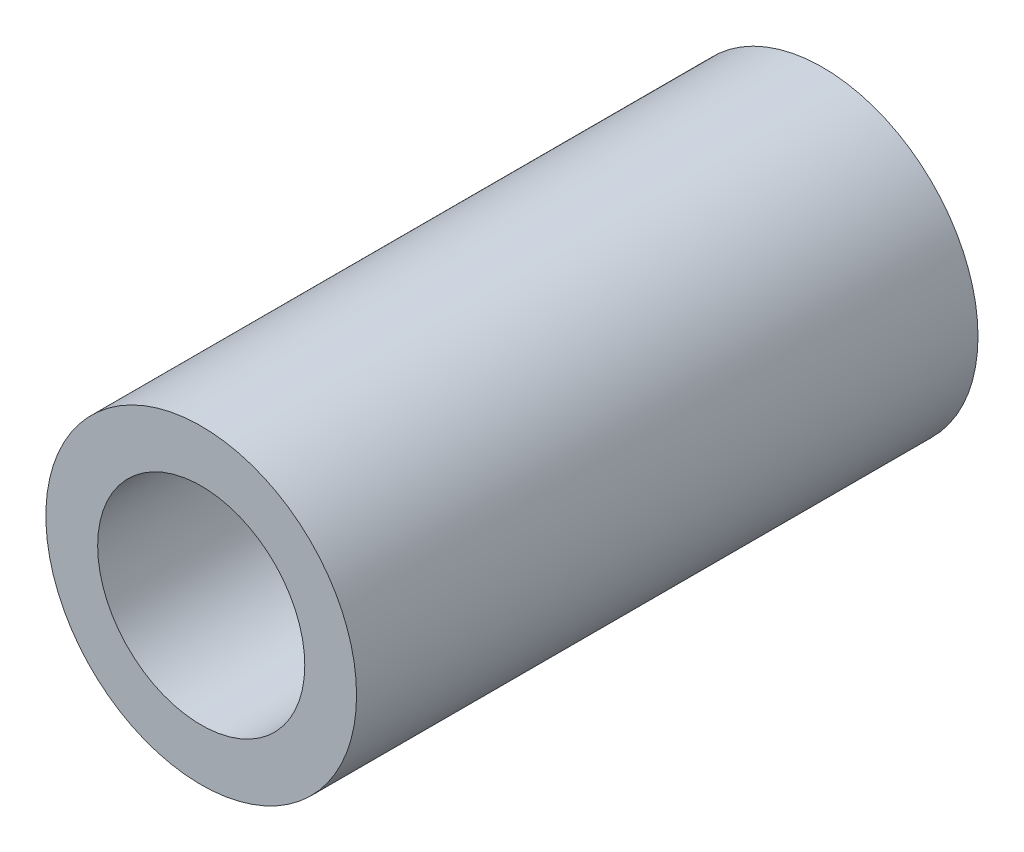
ISO-10303-21;
HEADER;
FILE_DESCRIPTION(('STEP AP214'),'2;1');
FILE_NAME('part.step','',(''),(''),'','','');
FILE_SCHEMA(('AUTOMOTIVE_DESIGN { 1 0 10303 214 1 1 1 1 }'));
ENDSEC;
DATA;
#1=APPLICATION_CONTEXT('core data for automotive mechanical design processes');
#2=APPLICATION_PROTOCOL_DEFINITION('international standard','automotive_design',2000,#1);
#3=PRODUCT_CONTEXT('',#1,'mechanical');
#4=PRODUCT('Part','Part','',(#3));
#5=PRODUCT_RELATED_PRODUCT_CATEGORY('part','',(#4));
#6=PRODUCT_DEFINITION_FORMATION('','',#4);
#7=PRODUCT_DEFINITION_CONTEXT('part definition',#1,'design');
#8=PRODUCT_DEFINITION('design','',#6,#7);
#9=PRODUCT_DEFINITION_SHAPE('','',#8);
#10=(LENGTH_UNIT() NAMED_UNIT(*) SI_UNIT(.MILLI.,.METRE.));
#11=(NAMED_UNIT(*) PLANE_ANGLE_UNIT() SI_UNIT($,.RADIAN.));
#12=(NAMED_UNIT(*) SI_UNIT($,.STERADIAN.) SOLID_ANGLE_UNIT());
#13=UNCERTAINTY_MEASURE_WITH_UNIT(LENGTH_MEASURE(1.E-05),#10,'distance_accuracy_value','');
#14=(GEOMETRIC_REPRESENTATION_CONTEXT(3) GLOBAL_UNCERTAINTY_ASSIGNED_CONTEXT((#13)) GLOBAL_UNIT_ASSIGNED_CONTEXT((#10,
#11,#12)) REPRESENTATION_CONTEXT('',''));
#15=CARTESIAN_POINT('',(0.,0.,0.));
#16=DIRECTION('',(0.,0.,1.));
#17=DIRECTION('',(1.,0.,0.));
#18=AXIS2_PLACEMENT_3D('',#15,#16,#17);
#19=CARTESIAN_POINT('',(0.,0.,60.));
#20=DIRECTION('',(0.,0.,1.));
#21=DIRECTION('',(1.,0.,0.));
#22=AXIS2_PLACEMENT_3D('',#19,#20,#21);
#23=PLANE('',#22);
#24=CARTESIAN_POINT('',(0.,0.,60.));
#25=DIRECTION('',(0.,0.,1.));
#26=DIRECTION('',(1.,0.,0.));
#27=AXIS2_PLACEMENT_3D('',#24,#25,#26);
#28=CIRCLE('',#27,15.);
#29=CARTESIAN_POINT('',(15.,0.,60.));
#30=VERTEX_POINT('',#29);
#31=EDGE_CURVE('E10',#30,#30,#28,.T.);
#32=ORIENTED_EDGE('',*,*,#31,.T.);
#33=EDGE_LOOP('',(#32));
#34=FACE_BOUND('',#33,.T.);
#35=CARTESIAN_POINT('',(0.,0.,60.));
#36=DIRECTION('',(0.,0.,1.));
#37=DIRECTION('',(1.,0.,0.));
#38=AXIS2_PLACEMENT_3D('',#35,#36,#37);
#39=CIRCLE('',#38,10.);
#40=CARTESIAN_POINT('',(10.,0.,60.));
#41=VERTEX_POINT('',#40);
#42=EDGE_CURVE('E42',#41,#41,#39,.T.);
#43=ORIENTED_EDGE('',*,*,#42,.F.);
#44=EDGE_LOOP('',(#43));
#45=FACE_BOUND('',#44,.T.);
#46=ADVANCED_FACE('F31',(#34,#45),#23,.T.);
#47=CARTESIAN_POINT('',(0.,0.,0.));
#48=DIRECTION('',(0.,0.,1.));
#49=DIRECTION('',(1.,0.,0.));
#50=AXIS2_PLACEMENT_3D('',#47,#48,#49);
#51=PLANE('',#50);
#52=CARTESIAN_POINT('',(0.,0.,0.));
#53=DIRECTION('',(0.,0.,1.));
#54=DIRECTION('',(1.,0.,0.));
#55=AXIS2_PLACEMENT_3D('',#52,#53,#54);
#56=CIRCLE('',#55,15.);
#57=CARTESIAN_POINT('',(15.,0.,0.));
#58=VERTEX_POINT('',#57);
#59=EDGE_CURVE('E35',#58,#58,#56,.T.);
#60=ORIENTED_EDGE('',*,*,#59,.F.);
#61=EDGE_LOOP('',(#60));
#62=FACE_BOUND('',#61,.T.);
#63=CARTESIAN_POINT('',(0.,0.,0.));
#64=DIRECTION('',(0.,0.,1.));
#65=DIRECTION('',(1.,0.,0.));
#66=AXIS2_PLACEMENT_3D('',#63,#64,#65);
#67=CIRCLE('',#66,10.);
#68=CARTESIAN_POINT('',(10.,0.,0.));
#69=VERTEX_POINT('',#68);
#70=EDGE_CURVE('E44',#69,#69,#67,.T.);
#71=ORIENTED_EDGE('',*,*,#70,.T.);
#72=EDGE_LOOP('',(#71));
#73=FACE_BOUND('',#72,.T.);
#74=ADVANCED_FACE('F54',(#62,#73),#51,.F.);
#75=CARTESIAN_POINT('',(0.,0.,60.));
#76=DIRECTION('',(0.,0.,-1.));
#77=DIRECTION('',(-1.,0.,0.));
#78=AXIS2_PLACEMENT_3D('',#75,#76,#77);
#79=CYLINDRICAL_SURFACE('',#78,15.);
#80=ORIENTED_EDGE('',*,*,#31,.F.);
#81=EDGE_LOOP('',(#80));
#82=FACE_BOUND('',#81,.T.);
#83=ORIENTED_EDGE('',*,*,#59,.T.);
#84=EDGE_LOOP('',(#83));
#85=FACE_BOUND('',#84,.T.);
#86=ADVANCED_FACE('F33',(#82,#85),#79,.T.);
#87=CARTESIAN_POINT('',(0.,0.,60.));
#88=DIRECTION('',(0.,0.,-1.));
#89=DIRECTION('',(-1.,0.,0.));
#90=AXIS2_PLACEMENT_3D('',#87,#88,#89);
#91=CYLINDRICAL_SURFACE('',#90,10.);
#92=ORIENTED_EDGE('',*,*,#42,.T.);
#93=EDGE_LOOP('',(#92));
#94=FACE_BOUND('',#93,.T.);
#95=ORIENTED_EDGE('',*,*,#70,.F.);
#96=EDGE_LOOP('',(#95));
#97=FACE_BOUND('',#96,.T.);
#98=ADVANCED_FACE('F50',(#94,#97),#91,.F.);
#99=CLOSED_SHELL('',(#46,#74,#86,#98));
#100=MANIFOLD_SOLID_BREP('B2',#99);
#101=ADVANCED_BREP_SHAPE_REPRESENTATION('',(#18,#100),#14);
#102=SHAPE_DEFINITION_REPRESENTATION(#9,#101);
ENDSEC;
END-ISO-10303-21;
